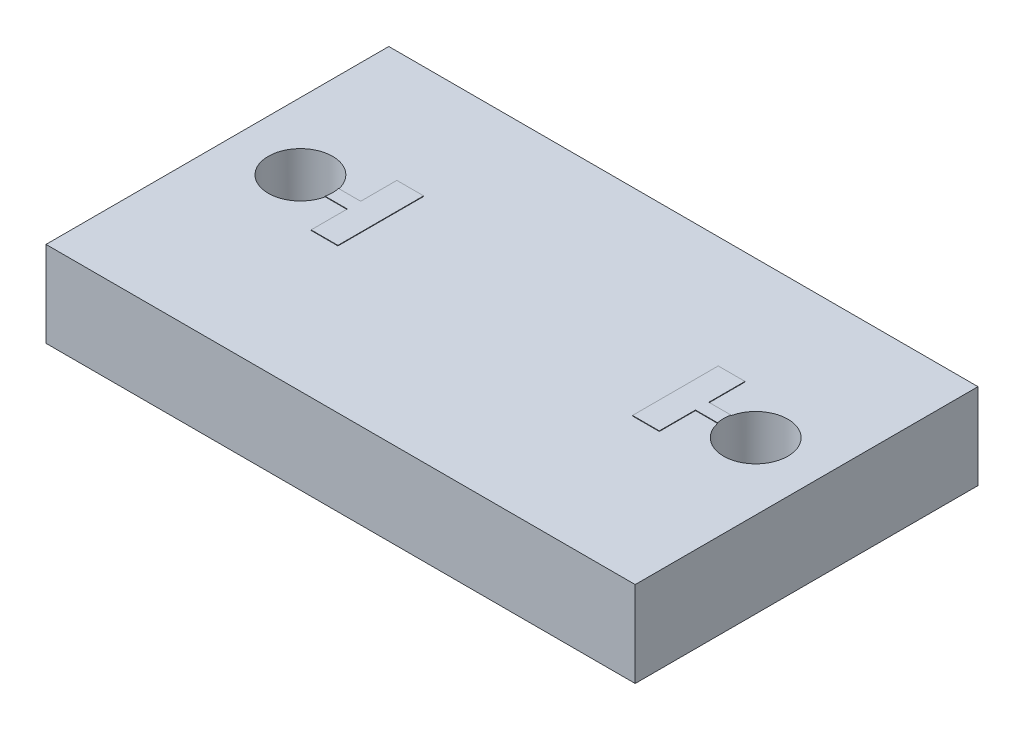
ISO-10303-21;
HEADER;
FILE_DESCRIPTION(('STEP AP214'),'2;1');
FILE_NAME('part.step','',(''),(''),'','','');
FILE_SCHEMA(('AUTOMOTIVE_DESIGN { 1 0 10303 214 1 1 1 1 }'));
ENDSEC;
DATA;
#1=APPLICATION_CONTEXT('core data for automotive mechanical design processes');
#2=APPLICATION_PROTOCOL_DEFINITION('international standard','automotive_design',2000,#1);
#3=PRODUCT_CONTEXT('',#1,'mechanical');
#4=PRODUCT('Part','Part','',(#3));
#5=PRODUCT_RELATED_PRODUCT_CATEGORY('part','',(#4));
#6=PRODUCT_DEFINITION_FORMATION('','',#4);
#7=PRODUCT_DEFINITION_CONTEXT('part definition',#1,'design');
#8=PRODUCT_DEFINITION('design','',#6,#7);
#9=PRODUCT_DEFINITION_SHAPE('','',#8);
#10=(LENGTH_UNIT() NAMED_UNIT(*) SI_UNIT(.MILLI.,.METRE.));
#11=(NAMED_UNIT(*) PLANE_ANGLE_UNIT() SI_UNIT($,.RADIAN.));
#12=(NAMED_UNIT(*) SI_UNIT($,.STERADIAN.) SOLID_ANGLE_UNIT());
#13=UNCERTAINTY_MEASURE_WITH_UNIT(LENGTH_MEASURE(1.E-05),#10,'distance_accuracy_value','');
#14=(GEOMETRIC_REPRESENTATION_CONTEXT(3) GLOBAL_UNCERTAINTY_ASSIGNED_CONTEXT((#13)) GLOBAL_UNIT_ASSIGNED_CONTEXT((#10,
#11,#12)) REPRESENTATION_CONTEXT('',''));
#15=CARTESIAN_POINT('',(0.,0.,0.));
#16=DIRECTION('',(0.,0.,1.));
#17=DIRECTION('',(1.,0.,0.));
#18=AXIS2_PLACEMENT_3D('',#15,#16,#17);
#19=CARTESIAN_POINT('',(0.,1.60000000000001,0.));
#20=DIRECTION('',(0.,-1.,0.));
#21=DIRECTION('',(0.,0.,-1.));
#22=AXIS2_PLACEMENT_3D('',#19,#20,#21);
#23=PLANE('',#22);
#24=DIRECTION('',(-1.,0.,0.));
#25=VECTOR('',#24,1.);
#26=CARTESIAN_POINT('',(0.,1.60000000000001,-0.125000000000004));
#27=LINE('',#26,#25);
#28=CARTESIAN_POINT('',(3.66316527028472,1.60000000000001,-0.125));
#29=VERTEX_POINT('',#28);
#30=CARTESIAN_POINT('',(3.25,1.60000000000001,-0.125000000000004));
#31=VERTEX_POINT('',#30);
#32=EDGE_CURVE('E232',#29,#31,#27,.T.);
#33=ORIENTED_EDGE('',*,*,#32,.F.);
#34=CARTESIAN_POINT('',(4.25,1.60000000000001,0.));
#35=DIRECTION('',(0.,1.,0.));
#36=DIRECTION('',(0.,0.,1.));
#37=AXIS2_PLACEMENT_3D('',#34,#35,#36);
#38=CIRCLE('',#37,0.6);
#39=CARTESIAN_POINT('',(3.66316527028473,1.60000000000001,0.125000000000005));
#40=VERTEX_POINT('',#39);
#41=EDGE_CURVE('E324',#40,#29,#38,.T.);
#42=ORIENTED_EDGE('',*,*,#41,.F.);
#43=DIRECTION('',(-1.,0.,0.));
#44=VECTOR('',#43,1.);
#45=CARTESIAN_POINT('',(0.,1.60000000000001,0.125000000000002));
#46=LINE('',#45,#44);
#47=CARTESIAN_POINT('',(3.25000000000001,1.60000000000001,0.125000000000002));
#48=VERTEX_POINT('',#47);
#49=EDGE_CURVE('E237',#40,#48,#46,.T.);
#50=ORIENTED_EDGE('',*,*,#49,.T.);
#51=DIRECTION('',(0.,0.,-1.));
#52=VECTOR('',#51,1.);
#53=CARTESIAN_POINT('',(3.25,1.60000000000001,0.));
#54=LINE('',#53,#52);
#55=CARTESIAN_POINT('',(3.25,1.60000000000001,0.799999999999999));
#56=VERTEX_POINT('',#55);
#57=EDGE_CURVE('E304',#56,#48,#54,.T.);
#58=ORIENTED_EDGE('',*,*,#57,.F.);
#59=DIRECTION('',(-1.,0.,0.));
#60=VECTOR('',#59,1.);
#61=CARTESIAN_POINT('',(0.,1.60000000000001,0.799999999999995));
#62=LINE('',#61,#60);
#63=CARTESIAN_POINT('',(2.75,1.60000000000001,0.799999999999995));
#64=VERTEX_POINT('',#63);
#65=EDGE_CURVE('E301',#56,#64,#62,.T.);
#66=ORIENTED_EDGE('',*,*,#65,.T.);
#67=DIRECTION('',(0.,0.,-1.));
#68=VECTOR('',#67,1.);
#69=CARTESIAN_POINT('',(2.75,1.60000000000001,0.));
#70=LINE('',#69,#68);
#71=CARTESIAN_POINT('',(2.75,1.60000000000001,-0.800000000000001));
#72=VERTEX_POINT('',#71);
#73=EDGE_CURVE('E285',#64,#72,#70,.T.);
#74=ORIENTED_EDGE('',*,*,#73,.T.);
#75=DIRECTION('',(-1.,0.,0.));
#76=VECTOR('',#75,1.);
#77=CARTESIAN_POINT('',(0.,1.60000000000001,-0.799999999999999));
#78=LINE('',#77,#76);
#79=CARTESIAN_POINT('',(3.25,1.60000000000001,-0.8));
#80=VERTEX_POINT('',#79);
#81=EDGE_CURVE('E290',#80,#72,#78,.T.);
#82=ORIENTED_EDGE('',*,*,#81,.F.);
#83=EDGE_CURVE('E303',#31,#80,#54,.T.);
#84=ORIENTED_EDGE('',*,*,#83,.F.);
#85=EDGE_LOOP('',(#33,#42,#50,#58,#66,#74,#82,#84));
#86=FACE_BOUND('',#85,.T.);
#87=DIRECTION('',(0.,0.,-1.));
#88=VECTOR('',#87,1.);
#89=CARTESIAN_POINT('',(5.5,1.60000000000002,2.));
#90=LINE('',#89,#88);
#91=CARTESIAN_POINT('',(5.5,1.60000000000001,3.50000000000001));
#92=VERTEX_POINT('',#91);
#93=CARTESIAN_POINT('',(5.50000000000001,1.60000000000002,-2.9));
#94=VERTEX_POINT('',#93);
#95=EDGE_CURVE('E49',#92,#94,#90,.T.);
#96=ORIENTED_EDGE('',*,*,#95,.T.);
#97=DIRECTION('',(1.,0.,0.));
#98=VECTOR('',#97,1.);
#99=CARTESIAN_POINT('',(-5.5,1.60000000000001,-2.9));
#100=LINE('',#99,#98);
#101=CARTESIAN_POINT('',(-5.5,1.60000000000001,-2.9));
#102=VERTEX_POINT('',#101);
#103=EDGE_CURVE('E187',#102,#94,#100,.T.);
#104=ORIENTED_EDGE('',*,*,#103,.F.);
#105=DIRECTION('',(0.,0.,1.));
#106=VECTOR('',#105,1.);
#107=CARTESIAN_POINT('',(-5.5,1.60000000000001,2.));
#108=LINE('',#107,#106);
#109=CARTESIAN_POINT('',(-5.5,1.60000000000001,3.50000000000001));
#110=VERTEX_POINT('',#109);
#111=EDGE_CURVE('E11',#102,#110,#108,.T.);
#112=ORIENTED_EDGE('',*,*,#111,.T.);
#113=DIRECTION('',(-1.,0.,0.));
#114=VECTOR('',#113,1.);
#115=CARTESIAN_POINT('',(-5.5,1.60000000000001,3.50000000000001));
#116=LINE('',#115,#114);
#117=EDGE_CURVE('E208',#92,#110,#116,.T.);
#118=ORIENTED_EDGE('',*,*,#117,.F.);
#119=EDGE_LOOP('',(#96,#104,#112,#118));
#120=FACE_BOUND('',#119,.T.);
#121=DIRECTION('',(1.,0.,0.));
#122=VECTOR('',#121,1.);
#123=CARTESIAN_POINT('',(0.,1.60000000000001,0.125000000000002));
#124=LINE('',#123,#122);
#125=CARTESIAN_POINT('',(-3.66316527028473,1.60000000000001,0.125000000000007));
#126=VERTEX_POINT('',#125);
#127=CARTESIAN_POINT('',(-3.25,1.60000000000001,0.125000000000009));
#128=VERTEX_POINT('',#127);
#129=EDGE_CURVE('E57',#126,#128,#124,.T.);
#130=ORIENTED_EDGE('',*,*,#129,.F.);
#131=CARTESIAN_POINT('',(-4.25,1.60000000000001,0.));
#132=DIRECTION('',(0.,1.,0.));
#133=DIRECTION('',(0.,0.,1.));
#134=AXIS2_PLACEMENT_3D('',#131,#132,#133);
#135=CIRCLE('',#134,0.6);
#136=CARTESIAN_POINT('',(-3.66316527028472,1.60000000000001,-0.125000000000004));
#137=VERTEX_POINT('',#136);
#138=EDGE_CURVE('E61',#126,#137,#135,.F.);
#139=ORIENTED_EDGE('',*,*,#138,.T.);
#140=DIRECTION('',(1.,0.,0.));
#141=VECTOR('',#140,1.);
#142=CARTESIAN_POINT('',(0.,1.60000000000001,-0.125000000000004));
#143=LINE('',#142,#141);
#144=CARTESIAN_POINT('',(-3.25,1.60000000000001,-0.125000000000002));
#145=VERTEX_POINT('',#144);
#146=EDGE_CURVE('E214',#137,#145,#143,.T.);
#147=ORIENTED_EDGE('',*,*,#146,.T.);
#148=DIRECTION('',(0.,0.,-1.));
#149=VECTOR('',#148,1.);
#150=CARTESIAN_POINT('',(-3.25,1.60000000000001,0.));
#151=LINE('',#150,#149);
#152=CARTESIAN_POINT('',(-3.25,1.60000000000001,-0.800000000000004));
#153=VERTEX_POINT('',#152);
#154=EDGE_CURVE('E254',#145,#153,#151,.T.);
#155=ORIENTED_EDGE('',*,*,#154,.T.);
#156=DIRECTION('',(1.,0.,0.));
#157=VECTOR('',#156,1.);
#158=CARTESIAN_POINT('',(0.,1.60000000000001,-0.799999999999999));
#159=LINE('',#158,#157);
#160=CARTESIAN_POINT('',(-2.75,1.60000000000001,-0.799999999999999));
#161=VERTEX_POINT('',#160);
#162=EDGE_CURVE('E272',#153,#161,#159,.T.);
#163=ORIENTED_EDGE('',*,*,#162,.T.);
#164=DIRECTION('',(0.,0.,-1.));
#165=VECTOR('',#164,1.);
#166=CARTESIAN_POINT('',(-2.75,1.60000000000001,0.));
#167=LINE('',#166,#165);
#168=CARTESIAN_POINT('',(-2.75,1.60000000000001,0.799999999999995));
#169=VERTEX_POINT('',#168);
#170=EDGE_CURVE('E270',#169,#161,#167,.T.);
#171=ORIENTED_EDGE('',*,*,#170,.F.);
#172=DIRECTION('',(1.,0.,0.));
#173=VECTOR('',#172,1.);
#174=CARTESIAN_POINT('',(0.,1.60000000000001,0.799999999999995));
#175=LINE('',#174,#173);
#176=CARTESIAN_POINT('',(-3.25,1.60000000000001,0.799999999999995));
#177=VERTEX_POINT('',#176);
#178=EDGE_CURVE('E268',#177,#169,#175,.T.);
#179=ORIENTED_EDGE('',*,*,#178,.F.);
#180=EDGE_CURVE('E266',#177,#128,#151,.T.);
#181=ORIENTED_EDGE('',*,*,#180,.T.);
#182=EDGE_LOOP('',(#130,#139,#147,#155,#163,#171,#179,#181));
#183=FACE_BOUND('',#182,.T.);
#184=ADVANCED_FACE('F40',(#86,#120,#183),#23,.F.);
#185=CARTESIAN_POINT('',(-3.25,1.61000000000001,0.));
#186=DIRECTION('',(-1.,0.,0.));
#187=DIRECTION('',(0.,0.,1.));
#188=AXIS2_PLACEMENT_3D('',#185,#186,#187);
#189=PLANE('',#188);
#190=DIRECTION('',(0.,0.,-1.));
#191=VECTOR('',#190,1.);
#192=CARTESIAN_POINT('',(-3.25,1.61000000000001,0.));
#193=LINE('',#192,#191);
#194=CARTESIAN_POINT('',(-3.25,1.61000000000001,0.799999999999995));
#195=VERTEX_POINT('',#194);
#196=CARTESIAN_POINT('',(-3.25,1.61,0.125000000000005));
#197=VERTEX_POINT('',#196);
#198=EDGE_CURVE('E255',#195,#197,#193,.T.);
#199=ORIENTED_EDGE('',*,*,#198,.T.);
#200=DIRECTION('',(0.,-1.,0.));
#201=VECTOR('',#200,1.);
#202=CARTESIAN_POINT('',(-3.25,1.61,0.125000000000005));
#203=LINE('',#202,#201);
#204=EDGE_CURVE('E227',#197,#128,#203,.T.);
#205=ORIENTED_EDGE('',*,*,#204,.T.);
#206=ORIENTED_EDGE('',*,*,#180,.F.);
#207=DIRECTION('',(0.,-1.,0.));
#208=VECTOR('',#207,1.);
#209=CARTESIAN_POINT('',(-3.25,1.61000000000001,0.799999999999995));
#210=LINE('',#209,#208);
#211=EDGE_CURVE('E283',#195,#177,#210,.T.);
#212=ORIENTED_EDGE('',*,*,#211,.F.);
#213=EDGE_LOOP('',(#199,#205,#206,#212));
#214=FACE_BOUND('',#213,.T.);
#215=ADVANCED_FACE('F349',(#214),#189,.T.);
#216=CARTESIAN_POINT('',(3.25,1.61000000000001,0.));
#217=DIRECTION('',(-1.,0.,0.));
#218=DIRECTION('',(0.,0.,1.));
#219=AXIS2_PLACEMENT_3D('',#216,#217,#218);
#220=PLANE('',#219);
#221=DIRECTION('',(0.,-1.,0.));
#222=VECTOR('',#221,1.);
#223=CARTESIAN_POINT('',(3.25,1.61000000000001,-0.125000000000004));
#224=LINE('',#223,#222);
#225=CARTESIAN_POINT('',(3.25,1.61000000000001,-0.125000000000004));
#226=VERTEX_POINT('',#225);
#227=EDGE_CURVE('E249',#226,#31,#224,.T.);
#228=ORIENTED_EDGE('',*,*,#227,.T.);
#229=ORIENTED_EDGE('',*,*,#83,.T.);
#230=DIRECTION('',(0.,-1.,0.));
#231=VECTOR('',#230,1.);
#232=CARTESIAN_POINT('',(3.25,1.61000000000001,-0.799999999999999));
#233=LINE('',#232,#231);
#234=CARTESIAN_POINT('',(3.25,1.61000000000001,-0.799999999999999));
#235=VERTEX_POINT('',#234);
#236=EDGE_CURVE('E311',#235,#80,#233,.T.);
#237=ORIENTED_EDGE('',*,*,#236,.F.);
#238=DIRECTION('',(0.,0.,-1.));
#239=VECTOR('',#238,1.);
#240=CARTESIAN_POINT('',(3.25,1.61000000000001,0.));
#241=LINE('',#240,#239);
#242=EDGE_CURVE('E293',#226,#235,#241,.T.);
#243=ORIENTED_EDGE('',*,*,#242,.F.);
#244=EDGE_LOOP('',(#228,#229,#237,#243));
#245=FACE_BOUND('',#244,.T.);
#246=ADVANCED_FACE('F345',(#245),#220,.F.);
#247=CARTESIAN_POINT('',(0.,0.,0.));
#248=DIRECTION('',(0.,-1.,0.));
#249=DIRECTION('',(0.,0.,-1.));
#250=AXIS2_PLACEMENT_3D('',#247,#248,#249);
#251=PLANE('',#250);
#252=CARTESIAN_POINT('',(-4.25,0.,0.));
#253=DIRECTION('',(0.,1.,0.));
#254=DIRECTION('',(0.,0.,1.));
#255=AXIS2_PLACEMENT_3D('',#252,#253,#254);
#256=CIRCLE('',#255,0.6);
#257=CARTESIAN_POINT('',(-4.25,0.,0.6));
#258=VERTEX_POINT('',#257);
#259=EDGE_CURVE('E327',#258,#258,#256,.F.);
#260=ORIENTED_EDGE('',*,*,#259,.F.);
#261=EDGE_LOOP('',(#260));
#262=FACE_BOUND('',#261,.T.);
#263=DIRECTION('',(0.,0.,-1.));
#264=VECTOR('',#263,1.);
#265=CARTESIAN_POINT('',(5.5,0.,2.));
#266=LINE('',#265,#264);
#267=CARTESIAN_POINT('',(5.5,0.,3.50000000000002));
#268=VERTEX_POINT('',#267);
#269=CARTESIAN_POINT('',(5.5,0.,-2.9));
#270=VERTEX_POINT('',#269);
#271=EDGE_CURVE('E323',#268,#270,#266,.T.);
#272=ORIENTED_EDGE('',*,*,#271,.F.);
#273=DIRECTION('',(1.,0.,0.));
#274=VECTOR('',#273,1.);
#275=CARTESIAN_POINT('',(-5.5,0.,3.50000000000001));
#276=LINE('',#275,#274);
#277=CARTESIAN_POINT('',(-5.5,0.,3.50000000000001));
#278=VERTEX_POINT('',#277);
#279=EDGE_CURVE('E202',#278,#268,#276,.T.);
#280=ORIENTED_EDGE('',*,*,#279,.F.);
#281=DIRECTION('',(0.,0.,1.));
#282=VECTOR('',#281,1.);
#283=CARTESIAN_POINT('',(-5.5,0.,2.));
#284=LINE('',#283,#282);
#285=CARTESIAN_POINT('',(-5.5,0.,-2.90000000000001));
#286=VERTEX_POINT('',#285);
#287=EDGE_CURVE('E44',#286,#278,#284,.T.);
#288=ORIENTED_EDGE('',*,*,#287,.F.);
#289=DIRECTION('',(-1.,0.,0.));
#290=VECTOR('',#289,1.);
#291=CARTESIAN_POINT('',(-5.5,0.,-2.90000000000001));
#292=LINE('',#291,#290);
#293=EDGE_CURVE('E196',#270,#286,#292,.T.);
#294=ORIENTED_EDGE('',*,*,#293,.F.);
#295=EDGE_LOOP('',(#272,#280,#288,#294));
#296=FACE_BOUND('',#295,.T.);
#297=CARTESIAN_POINT('',(4.25,0.,0.));
#298=DIRECTION('',(0.,1.,0.));
#299=DIRECTION('',(0.,0.,1.));
#300=AXIS2_PLACEMENT_3D('',#297,#298,#299);
#301=CIRCLE('',#300,0.6);
#302=CARTESIAN_POINT('',(4.25,0.,0.599999999999997));
#303=VERTEX_POINT('',#302);
#304=EDGE_CURVE('E320',#303,#303,#301,.T.);
#305=ORIENTED_EDGE('',*,*,#304,.T.);
#306=EDGE_LOOP('',(#305));
#307=FACE_BOUND('',#306,.T.);
#308=ADVANCED_FACE('F335',(#262,#296,#307),#251,.T.);
#309=CARTESIAN_POINT('',(5.5,1.60000000000002,2.));
#310=DIRECTION('',(-1.,0.,0.));
#311=DIRECTION('',(0.,0.,1.));
#312=AXIS2_PLACEMENT_3D('',#309,#310,#311);
#313=PLANE('',#312);
#314=ORIENTED_EDGE('',*,*,#271,.T.);
#315=DIRECTION('',(0.,-1.,0.));
#316=VECTOR('',#315,1.);
#317=CARTESIAN_POINT('',(5.50000000000001,1.60000000000002,-2.9));
#318=LINE('',#317,#316);
#319=EDGE_CURVE('E191',#94,#270,#318,.T.);
#320=ORIENTED_EDGE('',*,*,#319,.F.);
#321=ORIENTED_EDGE('',*,*,#95,.F.);
#322=DIRECTION('',(0.,1.,0.));
#323=VECTOR('',#322,1.);
#324=CARTESIAN_POINT('',(5.5,1.60000000000001,3.50000000000001));
#325=LINE('',#324,#323);
#326=EDGE_CURVE('E205',#268,#92,#325,.T.);
#327=ORIENTED_EDGE('',*,*,#326,.F.);
#328=EDGE_LOOP('',(#314,#320,#321,#327));
#329=FACE_BOUND('',#328,.T.);
#330=ADVANCED_FACE('F42',(#329),#313,.F.);
#331=CARTESIAN_POINT('',(-5.5,1.60000000000001,2.));
#332=DIRECTION('',(1.,0.,0.));
#333=DIRECTION('',(0.,0.,-1.));
#334=AXIS2_PLACEMENT_3D('',#331,#332,#333);
#335=PLANE('',#334);
#336=ORIENTED_EDGE('',*,*,#287,.T.);
#337=DIRECTION('',(0.,-1.,0.));
#338=VECTOR('',#337,1.);
#339=CARTESIAN_POINT('',(-5.5,1.60000000000001,3.50000000000001));
#340=LINE('',#339,#338);
#341=EDGE_CURVE('E182',#110,#278,#340,.T.);
#342=ORIENTED_EDGE('',*,*,#341,.F.);
#343=ORIENTED_EDGE('',*,*,#111,.F.);
#344=DIRECTION('',(0.,1.,0.));
#345=VECTOR('',#344,1.);
#346=CARTESIAN_POINT('',(-5.5,1.60000000000001,-2.9));
#347=LINE('',#346,#345);
#348=EDGE_CURVE('E180',#286,#102,#347,.T.);
#349=ORIENTED_EDGE('',*,*,#348,.F.);
#350=EDGE_LOOP('',(#336,#342,#343,#349));
#351=FACE_BOUND('',#350,.T.);
#352=ADVANCED_FACE('F178',(#351),#335,.F.);
#353=CARTESIAN_POINT('',(-4.25,0.,0.));
#354=DIRECTION('',(0.,1.,0.));
#355=DIRECTION('',(0.,0.,1.));
#356=AXIS2_PLACEMENT_3D('',#353,#354,#355);
#357=CYLINDRICAL_SURFACE('',#356,0.6);
#358=ORIENTED_EDGE('',*,*,#259,.T.);
#359=EDGE_LOOP('',(#358));
#360=FACE_BOUND('',#359,.T.);
#361=ORIENTED_EDGE('',*,*,#138,.F.);
#362=DIRECTION('',(0.,-1.,0.));
#363=VECTOR('',#362,1.);
#364=CARTESIAN_POINT('',(-3.66316527028473,1.61,0.125000000000007));
#365=LINE('',#364,#363);
#366=CARTESIAN_POINT('',(-3.66316527028473,1.61,0.125000000000007));
#367=VERTEX_POINT('',#366);
#368=EDGE_CURVE('E229',#367,#126,#365,.T.);
#369=ORIENTED_EDGE('',*,*,#368,.F.);
#370=CARTESIAN_POINT('',(-4.25,1.61000000000001,0.));
#371=DIRECTION('',(0.,1.,0.));
#372=DIRECTION('',(0.,0.,1.));
#373=AXIS2_PLACEMENT_3D('',#370,#371,#372);
#374=CIRCLE('',#373,0.6);
#375=CARTESIAN_POINT('',(-3.66316527028472,1.61000000000002,-0.125000000000004));
#376=VERTEX_POINT('',#375);
#377=EDGE_CURVE('E210',#376,#367,#374,.F.);
#378=ORIENTED_EDGE('',*,*,#377,.F.);
#379=DIRECTION('',(0.,-1.,0.));
#380=VECTOR('',#379,1.);
#381=CARTESIAN_POINT('',(-3.66316527028472,1.61000000000002,-0.125000000000004));
#382=LINE('',#381,#380);
#383=EDGE_CURVE('E220',#376,#137,#382,.T.);
#384=ORIENTED_EDGE('',*,*,#383,.T.);
#385=EDGE_LOOP('',(#361,#369,#378,#384));
#386=FACE_BOUND('',#385,.T.);
#387=ADVANCED_FACE('F344',(#360,#386),#357,.F.);
#388=CARTESIAN_POINT('',(4.25,0.,0.));
#389=DIRECTION('',(0.,1.,0.));
#390=DIRECTION('',(0.,0.,1.));
#391=AXIS2_PLACEMENT_3D('',#388,#389,#390);
#392=CYLINDRICAL_SURFACE('',#391,0.6);
#393=ORIENTED_EDGE('',*,*,#304,.F.);
#394=EDGE_LOOP('',(#393));
#395=FACE_BOUND('',#394,.T.);
#396=ORIENTED_EDGE('',*,*,#41,.T.);
#397=DIRECTION('',(0.,-1.,0.));
#398=VECTOR('',#397,1.);
#399=CARTESIAN_POINT('',(3.66316527028472,1.61000000000001,-0.125000000000004));
#400=LINE('',#399,#398);
#401=CARTESIAN_POINT('',(3.66316527028472,1.61000000000001,-0.125000000000004));
#402=VERTEX_POINT('',#401);
#403=EDGE_CURVE('E252',#402,#29,#400,.T.);
#404=ORIENTED_EDGE('',*,*,#403,.F.);
#405=CARTESIAN_POINT('',(4.25,1.61000000000002,0.));
#406=DIRECTION('',(0.,1.,0.));
#407=DIRECTION('',(0.,0.,1.));
#408=AXIS2_PLACEMENT_3D('',#405,#406,#407);
#409=CIRCLE('',#408,0.6);
#410=CARTESIAN_POINT('',(3.66316527028472,1.61,0.125000000000002));
#411=VERTEX_POINT('',#410);
#412=EDGE_CURVE('E233',#411,#402,#409,.F.);
#413=ORIENTED_EDGE('',*,*,#412,.F.);
#414=DIRECTION('',(0.,-1.,0.));
#415=VECTOR('',#414,1.);
#416=CARTESIAN_POINT('',(3.66316527028472,1.61,0.125000000000002));
#417=LINE('',#416,#415);
#418=EDGE_CURVE('E242',#411,#40,#417,.T.);
#419=ORIENTED_EDGE('',*,*,#418,.T.);
#420=EDGE_LOOP('',(#396,#404,#413,#419));
#421=FACE_BOUND('',#420,.T.);
#422=ADVANCED_FACE('F362',(#395,#421),#392,.F.);
#423=CARTESIAN_POINT('',(2.75,1.61000000000001,0.));
#424=DIRECTION('',(-1.,0.,0.));
#425=DIRECTION('',(0.,0.,1.));
#426=AXIS2_PLACEMENT_3D('',#423,#424,#425);
#427=PLANE('',#426);
#428=ORIENTED_EDGE('',*,*,#73,.F.);
#429=DIRECTION('',(0.,-1.,0.));
#430=VECTOR('',#429,1.);
#431=CARTESIAN_POINT('',(2.75,1.61000000000001,0.799999999999999));
#432=LINE('',#431,#430);
#433=CARTESIAN_POINT('',(2.75,1.61000000000001,0.799999999999999));
#434=VERTEX_POINT('',#433);
#435=EDGE_CURVE('E317',#434,#64,#432,.T.);
#436=ORIENTED_EDGE('',*,*,#435,.F.);
#437=DIRECTION('',(0.,0.,-1.));
#438=VECTOR('',#437,1.);
#439=CARTESIAN_POINT('',(2.75,1.61000000000001,0.));
#440=LINE('',#439,#438);
#441=CARTESIAN_POINT('',(2.75,1.61000000000001,-0.799999999999999));
#442=VERTEX_POINT('',#441);
#443=EDGE_CURVE('E286',#434,#442,#440,.T.);
#444=ORIENTED_EDGE('',*,*,#443,.T.);
#445=DIRECTION('',(0.,-1.,0.));
#446=VECTOR('',#445,1.);
#447=CARTESIAN_POINT('',(2.75,1.61000000000001,-0.799999999999999));
#448=LINE('',#447,#446);
#449=EDGE_CURVE('E299',#442,#72,#448,.T.);
#450=ORIENTED_EDGE('',*,*,#449,.T.);
#451=EDGE_LOOP('',(#428,#436,#444,#450));
#452=FACE_BOUND('',#451,.T.);
#453=ADVANCED_FACE('F366',(#452),#427,.T.);
#454=CARTESIAN_POINT('',(0.,1.61000000000001,0.8));
#455=DIRECTION('',(0.,0.,1.));
#456=DIRECTION('',(1.,0.,0.));
#457=AXIS2_PLACEMENT_3D('',#454,#455,#456);
#458=PLANE('',#457);
#459=ORIENTED_EDGE('',*,*,#65,.F.);
#460=DIRECTION('',(0.,-1.,0.));
#461=VECTOR('',#460,1.);
#462=CARTESIAN_POINT('',(3.25,1.61000000000001,0.799999999999993));
#463=LINE('',#462,#461);
#464=CARTESIAN_POINT('',(3.25,1.61000000000001,0.799999999999993));
#465=VERTEX_POINT('',#464);
#466=EDGE_CURVE('E314',#465,#56,#463,.T.);
#467=ORIENTED_EDGE('',*,*,#466,.F.);
#468=DIRECTION('',(-1.,0.,0.));
#469=VECTOR('',#468,1.);
#470=CARTESIAN_POINT('',(0.,1.61000000000001,0.8));
#471=LINE('',#470,#469);
#472=EDGE_CURVE('E289',#465,#434,#471,.T.);
#473=ORIENTED_EDGE('',*,*,#472,.T.);
#474=ORIENTED_EDGE('',*,*,#435,.T.);
#475=EDGE_LOOP('',(#459,#467,#473,#474));
#476=FACE_BOUND('',#475,.T.);
#477=ADVANCED_FACE('F370',(#476),#458,.T.);
#478=ORIENTED_EDGE('',*,*,#57,.T.);
#479=DIRECTION('',(0.,-1.,0.));
#480=VECTOR('',#479,1.);
#481=CARTESIAN_POINT('',(3.25,1.61,0.125000000000004));
#482=LINE('',#481,#480);
#483=CARTESIAN_POINT('',(3.25,1.61,0.125000000000004));
#484=VERTEX_POINT('',#483);
#485=EDGE_CURVE('E247',#484,#48,#482,.T.);
#486=ORIENTED_EDGE('',*,*,#485,.F.);
#487=EDGE_CURVE('E294',#465,#484,#241,.T.);
#488=ORIENTED_EDGE('',*,*,#487,.F.);
#489=ORIENTED_EDGE('',*,*,#466,.T.);
#490=EDGE_LOOP('',(#478,#486,#488,#489));
#491=FACE_BOUND('',#490,.T.);
#492=ADVANCED_FACE('F374',(#491),#220,.F.);
#493=CARTESIAN_POINT('',(0.,1.61000000000001,-0.8));
#494=DIRECTION('',(0.,0.,1.));
#495=DIRECTION('',(1.,0.,0.));
#496=AXIS2_PLACEMENT_3D('',#493,#494,#495);
#497=PLANE('',#496);
#498=ORIENTED_EDGE('',*,*,#81,.T.);
#499=ORIENTED_EDGE('',*,*,#449,.F.);
#500=DIRECTION('',(-1.,0.,0.));
#501=VECTOR('',#500,1.);
#502=CARTESIAN_POINT('',(0.,1.61000000000001,-0.8));
#503=LINE('',#502,#501);
#504=EDGE_CURVE('E297',#235,#442,#503,.T.);
#505=ORIENTED_EDGE('',*,*,#504,.F.);
#506=ORIENTED_EDGE('',*,*,#236,.T.);
#507=EDGE_LOOP('',(#498,#499,#505,#506));
#508=FACE_BOUND('',#507,.T.);
#509=ADVANCED_FACE('F378',(#508),#497,.F.);
#510=CARTESIAN_POINT('',(0.,1.61,0.));
#511=DIRECTION('',(0.,1.,0.));
#512=DIRECTION('',(0.,0.,1.));
#513=AXIS2_PLACEMENT_3D('',#510,#511,#512);
#514=PLANE('',#513);
#515=ORIENTED_EDGE('',*,*,#443,.F.);
#516=ORIENTED_EDGE('',*,*,#472,.F.);
#517=ORIENTED_EDGE('',*,*,#487,.T.);
#518=DIRECTION('',(-1.,0.,0.));
#519=VECTOR('',#518,1.);
#520=CARTESIAN_POINT('',(0.,1.61,0.125000000000004));
#521=LINE('',#520,#519);
#522=EDGE_CURVE('E240',#411,#484,#521,.T.);
#523=ORIENTED_EDGE('',*,*,#522,.F.);
#524=ORIENTED_EDGE('',*,*,#412,.T.);
#525=DIRECTION('',(-1.,0.,0.));
#526=VECTOR('',#525,1.);
#527=CARTESIAN_POINT('',(0.,1.61000000000001,-0.125000000000004));
#528=LINE('',#527,#526);
#529=EDGE_CURVE('E236',#402,#226,#528,.T.);
#530=ORIENTED_EDGE('',*,*,#529,.T.);
#531=ORIENTED_EDGE('',*,*,#242,.T.);
#532=ORIENTED_EDGE('',*,*,#504,.T.);
#533=EDGE_LOOP('',(#515,#516,#517,#523,#524,#530,#531,#532));
#534=FACE_BOUND('',#533,.T.);
#535=ADVANCED_FACE('F382',(#534),#514,.T.);
#536=DIRECTION('',(0.,-1.,0.));
#537=VECTOR('',#536,1.);
#538=CARTESIAN_POINT('',(-3.25,1.61000000000001,-0.125000000000002));
#539=LINE('',#538,#537);
#540=CARTESIAN_POINT('',(-3.25,1.61000000000001,-0.125000000000002));
#541=VERTEX_POINT('',#540);
#542=EDGE_CURVE('E224',#541,#145,#539,.T.);
#543=ORIENTED_EDGE('',*,*,#542,.F.);
#544=CARTESIAN_POINT('',(-3.25,1.61000000000001,-0.799999999999999));
#545=VERTEX_POINT('',#544);
#546=EDGE_CURVE('E258',#541,#545,#193,.T.);
#547=ORIENTED_EDGE('',*,*,#546,.T.);
#548=DIRECTION('',(0.,-1.,0.));
#549=VECTOR('',#548,1.);
#550=CARTESIAN_POINT('',(-3.25,1.61000000000001,-0.799999999999999));
#551=LINE('',#550,#549);
#552=EDGE_CURVE('E265',#545,#153,#551,.T.);
#553=ORIENTED_EDGE('',*,*,#552,.T.);
#554=ORIENTED_EDGE('',*,*,#154,.F.);
#555=EDGE_LOOP('',(#543,#547,#553,#554));
#556=FACE_BOUND('',#555,.T.);
#557=ADVANCED_FACE('F357',(#556),#189,.T.);
#558=CARTESIAN_POINT('',(0.,1.61000000000001,0.8));
#559=DIRECTION('',(0.,0.,-1.));
#560=DIRECTION('',(-1.,0.,0.));
#561=AXIS2_PLACEMENT_3D('',#558,#559,#560);
#562=PLANE('',#561);
#563=ORIENTED_EDGE('',*,*,#178,.T.);
#564=DIRECTION('',(0.,-1.,0.));
#565=VECTOR('',#564,1.);
#566=CARTESIAN_POINT('',(-2.75,1.61000000000001,0.799999999999997));
#567=LINE('',#566,#565);
#568=CARTESIAN_POINT('',(-2.75,1.61000000000001,0.799999999999997));
#569=VERTEX_POINT('',#568);
#570=EDGE_CURVE('E280',#569,#169,#567,.T.);
#571=ORIENTED_EDGE('',*,*,#570,.F.);
#572=DIRECTION('',(1.,0.,0.));
#573=VECTOR('',#572,1.);
#574=CARTESIAN_POINT('',(0.,1.61000000000001,0.8));
#575=LINE('',#574,#573);
#576=EDGE_CURVE('E257',#195,#569,#575,.T.);
#577=ORIENTED_EDGE('',*,*,#576,.F.);
#578=ORIENTED_EDGE('',*,*,#211,.T.);
#579=EDGE_LOOP('',(#563,#571,#577,#578));
#580=FACE_BOUND('',#579,.T.);
#581=ADVANCED_FACE('F388',(#580),#562,.F.);
#582=CARTESIAN_POINT('',(-2.75,1.61000000000002,0.));
#583=DIRECTION('',(-1.,0.,0.));
#584=DIRECTION('',(0.,0.,1.));
#585=AXIS2_PLACEMENT_3D('',#582,#583,#584);
#586=PLANE('',#585);
#587=ORIENTED_EDGE('',*,*,#170,.T.);
#588=DIRECTION('',(0.,-1.,0.));
#589=VECTOR('',#588,1.);
#590=CARTESIAN_POINT('',(-2.75,1.61000000000002,-0.8));
#591=LINE('',#590,#589);
#592=CARTESIAN_POINT('',(-2.75,1.61000000000002,-0.8));
#593=VERTEX_POINT('',#592);
#594=EDGE_CURVE('E277',#593,#161,#591,.T.);
#595=ORIENTED_EDGE('',*,*,#594,.F.);
#596=DIRECTION('',(0.,0.,-1.));
#597=VECTOR('',#596,1.);
#598=CARTESIAN_POINT('',(-2.75,1.61000000000002,0.));
#599=LINE('',#598,#597);
#600=EDGE_CURVE('E260',#569,#593,#599,.T.);
#601=ORIENTED_EDGE('',*,*,#600,.F.);
#602=ORIENTED_EDGE('',*,*,#570,.T.);
#603=EDGE_LOOP('',(#587,#595,#601,#602));
#604=FACE_BOUND('',#603,.T.);
#605=ADVANCED_FACE('F392',(#604),#586,.F.);
#606=CARTESIAN_POINT('',(0.,1.61000000000001,-0.8));
#607=DIRECTION('',(0.,0.,-1.));
#608=DIRECTION('',(-1.,0.,0.));
#609=AXIS2_PLACEMENT_3D('',#606,#607,#608);
#610=PLANE('',#609);
#611=ORIENTED_EDGE('',*,*,#162,.F.);
#612=ORIENTED_EDGE('',*,*,#552,.F.);
#613=DIRECTION('',(1.,0.,0.));
#614=VECTOR('',#613,1.);
#615=CARTESIAN_POINT('',(0.,1.61000000000001,-0.8));
#616=LINE('',#615,#614);
#617=EDGE_CURVE('E262',#545,#593,#616,.T.);
#618=ORIENTED_EDGE('',*,*,#617,.T.);
#619=ORIENTED_EDGE('',*,*,#594,.T.);
#620=EDGE_LOOP('',(#611,#612,#618,#619));
#621=FACE_BOUND('',#620,.T.);
#622=ADVANCED_FACE('F396',(#621),#610,.T.);
#623=CARTESIAN_POINT('',(0.,1.61,0.));
#624=DIRECTION('',(0.,1.,0.));
#625=DIRECTION('',(0.,0.,1.));
#626=AXIS2_PLACEMENT_3D('',#623,#624,#625);
#627=PLANE('',#626);
#628=ORIENTED_EDGE('',*,*,#198,.F.);
#629=ORIENTED_EDGE('',*,*,#576,.T.);
#630=ORIENTED_EDGE('',*,*,#600,.T.);
#631=ORIENTED_EDGE('',*,*,#617,.F.);
#632=ORIENTED_EDGE('',*,*,#546,.F.);
#633=DIRECTION('',(1.,0.,0.));
#634=VECTOR('',#633,1.);
#635=CARTESIAN_POINT('',(0.,1.61000000000001,-0.125000000000004));
#636=LINE('',#635,#634);
#637=EDGE_CURVE('E217',#376,#541,#636,.T.);
#638=ORIENTED_EDGE('',*,*,#637,.F.);
#639=ORIENTED_EDGE('',*,*,#377,.T.);
#640=DIRECTION('',(1.,0.,0.));
#641=VECTOR('',#640,1.);
#642=CARTESIAN_POINT('',(0.,1.61,0.125000000000004));
#643=LINE('',#642,#641);
#644=EDGE_CURVE('E213',#367,#197,#643,.T.);
#645=ORIENTED_EDGE('',*,*,#644,.T.);
#646=EDGE_LOOP('',(#628,#629,#630,#631,#632,#638,#639,#645));
#647=FACE_BOUND('',#646,.T.);
#648=ADVANCED_FACE('F400',(#647),#627,.T.);
#649=CARTESIAN_POINT('',(0.,1.61000000000001,-0.125000000000004));
#650=DIRECTION('',(0.,0.,1.));
#651=DIRECTION('',(1.,0.,0.));
#652=AXIS2_PLACEMENT_3D('',#649,#650,#651);
#653=PLANE('',#652);
#654=ORIENTED_EDGE('',*,*,#32,.T.);
#655=ORIENTED_EDGE('',*,*,#227,.F.);
#656=ORIENTED_EDGE('',*,*,#529,.F.);
#657=ORIENTED_EDGE('',*,*,#403,.T.);
#658=EDGE_LOOP('',(#654,#655,#656,#657));
#659=FACE_BOUND('',#658,.T.);
#660=ADVANCED_FACE('F404',(#659),#653,.F.);
#661=CARTESIAN_POINT('',(0.,1.61,0.125000000000004));
#662=DIRECTION('',(0.,0.,1.));
#663=DIRECTION('',(1.,0.,0.));
#664=AXIS2_PLACEMENT_3D('',#661,#662,#663);
#665=PLANE('',#664);
#666=ORIENTED_EDGE('',*,*,#49,.F.);
#667=ORIENTED_EDGE('',*,*,#418,.F.);
#668=ORIENTED_EDGE('',*,*,#522,.T.);
#669=ORIENTED_EDGE('',*,*,#485,.T.);
#670=EDGE_LOOP('',(#666,#667,#668,#669));
#671=FACE_BOUND('',#670,.T.);
#672=ADVANCED_FACE('F408',(#671),#665,.T.);
#673=CARTESIAN_POINT('',(0.,1.61,0.125000000000004));
#674=DIRECTION('',(0.,0.,-1.));
#675=DIRECTION('',(-1.,0.,0.));
#676=AXIS2_PLACEMENT_3D('',#673,#674,#675);
#677=PLANE('',#676);
#678=ORIENTED_EDGE('',*,*,#129,.T.);
#679=ORIENTED_EDGE('',*,*,#204,.F.);
#680=ORIENTED_EDGE('',*,*,#644,.F.);
#681=ORIENTED_EDGE('',*,*,#368,.T.);
#682=EDGE_LOOP('',(#678,#679,#680,#681));
#683=FACE_BOUND('',#682,.T.);
#684=ADVANCED_FACE('F412',(#683),#677,.F.);
#685=CARTESIAN_POINT('',(0.,1.61000000000001,-0.125000000000004));
#686=DIRECTION('',(0.,0.,-1.));
#687=DIRECTION('',(-1.,0.,0.));
#688=AXIS2_PLACEMENT_3D('',#685,#686,#687);
#689=PLANE('',#688);
#690=ORIENTED_EDGE('',*,*,#146,.F.);
#691=ORIENTED_EDGE('',*,*,#383,.F.);
#692=ORIENTED_EDGE('',*,*,#637,.T.);
#693=ORIENTED_EDGE('',*,*,#542,.T.);
#694=EDGE_LOOP('',(#690,#691,#692,#693));
#695=FACE_BOUND('',#694,.T.);
#696=ADVANCED_FACE('F416',(#695),#689,.T.);
#697=CARTESIAN_POINT('',(0.,0.,3.50000000000001));
#698=DIRECTION('',(0.,0.,1.));
#699=DIRECTION('',(1.,0.,0.));
#700=AXIS2_PLACEMENT_3D('',#697,#698,#699);
#701=PLANE('',#700);
#702=ORIENTED_EDGE('',*,*,#341,.T.);
#703=ORIENTED_EDGE('',*,*,#279,.T.);
#704=ORIENTED_EDGE('',*,*,#326,.T.);
#705=ORIENTED_EDGE('',*,*,#117,.T.);
#706=EDGE_LOOP('',(#702,#703,#704,#705));
#707=FACE_BOUND('',#706,.T.);
#708=ADVANCED_FACE('F338',(#707),#701,.T.);
#709=CARTESIAN_POINT('',(0.,0.,-2.9));
#710=DIRECTION('',(0.,0.,1.));
#711=DIRECTION('',(1.,0.,0.));
#712=AXIS2_PLACEMENT_3D('',#709,#710,#711);
#713=PLANE('',#712);
#714=ORIENTED_EDGE('',*,*,#348,.T.);
#715=ORIENTED_EDGE('',*,*,#103,.T.);
#716=ORIENTED_EDGE('',*,*,#319,.T.);
#717=ORIENTED_EDGE('',*,*,#293,.T.);
#718=EDGE_LOOP('',(#714,#715,#716,#717));
#719=FACE_BOUND('',#718,.T.);
#720=ADVANCED_FACE('F194',(#719),#713,.F.);
#721=CLOSED_SHELL('',(#184,#215,#246,#308,#330,#352,#387,#422,#453,#477,#492,#509,#535,#557,
#581,#605,#622,#648,#660,#672,#684,#696,#708,#720));
#722=MANIFOLD_SOLID_BREP('B2',#721);
#723=ADVANCED_BREP_SHAPE_REPRESENTATION('',(#18,#722),#14);
#724=SHAPE_DEFINITION_REPRESENTATION(#9,#723);
ENDSEC;
END-ISO-10303-21;
